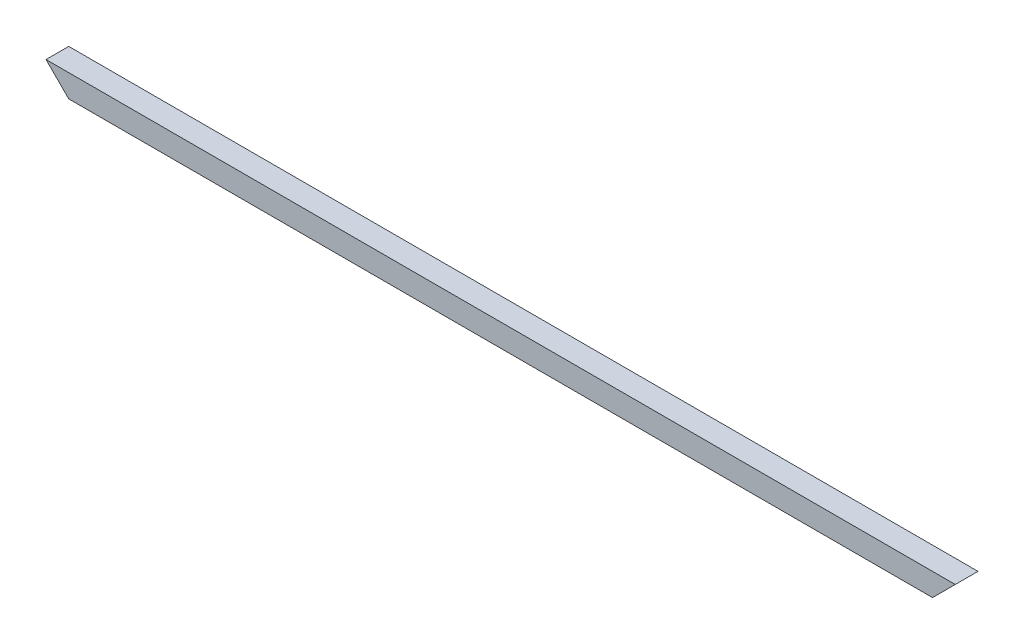
ISO-10303-21;
HEADER;
FILE_DESCRIPTION(('STEP AP214'),'2;1');
FILE_NAME('part.step','',(''),(''),'','','');
FILE_SCHEMA(('AUTOMOTIVE_DESIGN { 1 0 10303 214 1 1 1 1 }'));
ENDSEC;
DATA;
#1=APPLICATION_CONTEXT('core data for automotive mechanical design processes');
#2=APPLICATION_PROTOCOL_DEFINITION('international standard','automotive_design',2000,#1);
#3=PRODUCT_CONTEXT('',#1,'mechanical');
#4=PRODUCT('Part','Part','',(#3));
#5=PRODUCT_RELATED_PRODUCT_CATEGORY('part','',(#4));
#6=PRODUCT_DEFINITION_FORMATION('','',#4);
#7=PRODUCT_DEFINITION_CONTEXT('part definition',#1,'design');
#8=PRODUCT_DEFINITION('design','',#6,#7);
#9=PRODUCT_DEFINITION_SHAPE('','',#8);
#10=(LENGTH_UNIT() NAMED_UNIT(*) SI_UNIT(.MILLI.,.METRE.));
#11=(NAMED_UNIT(*) PLANE_ANGLE_UNIT() SI_UNIT($,.RADIAN.));
#12=(NAMED_UNIT(*) SI_UNIT($,.STERADIAN.) SOLID_ANGLE_UNIT());
#13=UNCERTAINTY_MEASURE_WITH_UNIT(LENGTH_MEASURE(1.E-05),#10,'distance_accuracy_value','');
#14=(GEOMETRIC_REPRESENTATION_CONTEXT(3) GLOBAL_UNCERTAINTY_ASSIGNED_CONTEXT((#13)) GLOBAL_UNIT_ASSIGNED_CONTEXT((#10,
#11,#12)) REPRESENTATION_CONTEXT('',''));
#15=CARTESIAN_POINT('',(0.,0.,0.));
#16=DIRECTION('',(0.,0.,1.));
#17=DIRECTION('',(1.,0.,0.));
#18=AXIS2_PLACEMENT_3D('',#15,#16,#17);
#19=CARTESIAN_POINT('',(800.,-10.,-10.));
#20=DIRECTION('',(0.,0.,1.));
#21=DIRECTION('',(1.,0.,0.));
#22=AXIS2_PLACEMENT_3D('',#19,#20,#21);
#23=PLANE('',#22);
#24=DIRECTION('',(0.70710678118654,0.707106781186555,0.));
#25=VECTOR('',#24,1.);
#26=CARTESIAN_POINT('',(790.,-2.15105711021124E-13,-10.));
#27=LINE('',#26,#25);
#28=CARTESIAN_POINT('',(780.,-10.,-10.));
#29=VERTEX_POINT('',#28);
#30=CARTESIAN_POINT('',(800.,10.,-10.));
#31=VERTEX_POINT('',#30);
#32=EDGE_CURVE('E114',#29,#31,#27,.T.);
#33=ORIENTED_EDGE('',*,*,#32,.F.);
#34=DIRECTION('',(-1.,0.,0.));
#35=VECTOR('',#34,1.);
#36=CARTESIAN_POINT('',(800.,-10.,-10.));
#37=LINE('',#36,#35);
#38=CARTESIAN_POINT('',(20.0000000000006,-10.,-10.));
#39=VERTEX_POINT('',#38);
#40=EDGE_CURVE('E100',#29,#39,#37,.T.);
#41=ORIENTED_EDGE('',*,*,#40,.T.);
#42=DIRECTION('',(-0.707106781186556,0.707106781186539,0.));
#43=VECTOR('',#42,1.);
#44=CARTESIAN_POINT('',(410.000000000009,-400.,-10.));
#45=LINE('',#44,#43);
#46=CARTESIAN_POINT('',(0.,10.,-10.));
#47=VERTEX_POINT('',#46);
#48=EDGE_CURVE('E157',#39,#47,#45,.T.);
#49=ORIENTED_EDGE('',*,*,#48,.T.);
#50=DIRECTION('',(-1.,0.,0.));
#51=VECTOR('',#50,1.);
#52=CARTESIAN_POINT('',(800.,10.,-10.));
#53=LINE('',#52,#51);
#54=EDGE_CURVE('E116',#31,#47,#53,.T.);
#55=ORIENTED_EDGE('',*,*,#54,.F.);
#56=EDGE_LOOP('',(#33,#41,#49,#55));
#57=FACE_BOUND('',#56,.T.);
#58=ADVANCED_FACE('F38',(#57),#23,.F.);
#59=CARTESIAN_POINT('',(800.,-10.,10.));
#60=DIRECTION('',(0.,0.,-1.));
#61=DIRECTION('',(-1.,0.,0.));
#62=AXIS2_PLACEMENT_3D('',#59,#60,#61);
#63=PLANE('',#62);
#64=DIRECTION('',(-0.70710678118654,-0.707106781186555,0.));
#65=VECTOR('',#64,1.);
#66=CARTESIAN_POINT('',(790.,-2.15105711021124E-13,10.));
#67=LINE('',#66,#65);
#68=CARTESIAN_POINT('',(800.,10.,10.));
#69=VERTEX_POINT('',#68);
#70=CARTESIAN_POINT('',(780.,-10.,10.));
#71=VERTEX_POINT('',#70);
#72=EDGE_CURVE('E120',#69,#71,#67,.T.);
#73=ORIENTED_EDGE('',*,*,#72,.F.);
#74=DIRECTION('',(-1.,0.,0.));
#75=VECTOR('',#74,1.);
#76=CARTESIAN_POINT('',(800.,10.,10.));
#77=LINE('',#76,#75);
#78=CARTESIAN_POINT('',(0.,10.,10.));
#79=VERTEX_POINT('',#78);
#80=EDGE_CURVE('E180',#69,#79,#77,.T.);
#81=ORIENTED_EDGE('',*,*,#80,.T.);
#82=DIRECTION('',(0.707106781186556,-0.707106781186539,0.));
#83=VECTOR('',#82,1.);
#84=CARTESIAN_POINT('',(410.000000000009,-400.,10.));
#85=LINE('',#84,#83);
#86=CARTESIAN_POINT('',(20.0000000000005,-10.,10.));
#87=VERTEX_POINT('',#86);
#88=EDGE_CURVE('E153',#79,#87,#85,.T.);
#89=ORIENTED_EDGE('',*,*,#88,.T.);
#90=DIRECTION('',(-1.,0.,0.));
#91=VECTOR('',#90,1.);
#92=CARTESIAN_POINT('',(800.,-10.,10.));
#93=LINE('',#92,#91);
#94=EDGE_CURVE('E109',#71,#87,#93,.T.);
#95=ORIENTED_EDGE('',*,*,#94,.F.);
#96=EDGE_LOOP('',(#73,#81,#89,#95));
#97=FACE_BOUND('',#96,.T.);
#98=ADVANCED_FACE('F214',(#97),#63,.F.);
#99=CARTESIAN_POINT('',(800.,-10.,10.));
#100=DIRECTION('',(0.,1.,0.));
#101=DIRECTION('',(0.,0.,1.));
#102=AXIS2_PLACEMENT_3D('',#99,#100,#101);
#103=PLANE('',#102);
#104=DIRECTION('',(0.,0.,-1.));
#105=VECTOR('',#104,1.);
#106=CARTESIAN_POINT('',(780.,-10.,1035.62480480947));
#107=LINE('',#106,#105);
#108=EDGE_CURVE('E53',#71,#29,#107,.T.);
#109=ORIENTED_EDGE('',*,*,#108,.F.);
#110=ORIENTED_EDGE('',*,*,#94,.T.);
#111=DIRECTION('',(0.,0.,-1.));
#112=VECTOR('',#111,1.);
#113=CARTESIAN_POINT('',(20.0000000000005,-10.,1035.62480480947));
#114=LINE('',#113,#112);
#115=EDGE_CURVE('E104',#87,#39,#114,.T.);
#116=ORIENTED_EDGE('',*,*,#115,.T.);
#117=ORIENTED_EDGE('',*,*,#40,.F.);
#118=EDGE_LOOP('',(#109,#110,#116,#117));
#119=FACE_BOUND('',#118,.T.);
#120=ADVANCED_FACE('F102',(#119),#103,.F.);
#121=CARTESIAN_POINT('',(800.,-8.8,8.8));
#122=DIRECTION('',(0.,0.,-1.));
#123=DIRECTION('',(-1.,0.,0.));
#124=AXIS2_PLACEMENT_3D('',#121,#122,#123);
#125=PLANE('',#124);
#126=DIRECTION('',(-1.,0.,0.));
#127=VECTOR('',#126,1.);
#128=CARTESIAN_POINT('',(800.,8.8,8.8));
#129=LINE('',#128,#127);
#130=CARTESIAN_POINT('',(798.8,8.8,8.8));
#131=VERTEX_POINT('',#130);
#132=CARTESIAN_POINT('',(1.20000000000009,8.8,8.8));
#133=VERTEX_POINT('',#132);
#134=EDGE_CURVE('E160',#131,#133,#129,.T.);
#135=ORIENTED_EDGE('',*,*,#134,.F.);
#136=DIRECTION('',(-0.70710678118654,-0.707106781186555,0.));
#137=VECTOR('',#136,1.);
#138=CARTESIAN_POINT('',(790.6,0.599999999999797,8.8));
#139=LINE('',#138,#137);
#140=CARTESIAN_POINT('',(781.200000000001,-8.8,8.8));
#141=VERTEX_POINT('',#140);
#142=EDGE_CURVE('E61',#131,#141,#139,.T.);
#143=ORIENTED_EDGE('',*,*,#142,.T.);
#144=DIRECTION('',(-1.,0.,0.));
#145=VECTOR('',#144,1.);
#146=CARTESIAN_POINT('',(800.,-8.8,8.8));
#147=LINE('',#146,#145);
#148=CARTESIAN_POINT('',(18.8000000000005,-8.8,8.8));
#149=VERTEX_POINT('',#148);
#150=EDGE_CURVE('E169',#141,#149,#147,.T.);
#151=ORIENTED_EDGE('',*,*,#150,.T.);
#152=DIRECTION('',(0.707106781186556,-0.707106781186539,0.));
#153=VECTOR('',#152,1.);
#154=CARTESIAN_POINT('',(409.400000000009,-399.4,8.8));
#155=LINE('',#154,#153);
#156=EDGE_CURVE('E149',#133,#149,#155,.T.);
#157=ORIENTED_EDGE('',*,*,#156,.F.);
#158=EDGE_LOOP('',(#135,#143,#151,#157));
#159=FACE_BOUND('',#158,.T.);
#160=ADVANCED_FACE('F198',(#159),#125,.T.);
#161=CARTESIAN_POINT('',(800.,-8.8,8.8));
#162=DIRECTION('',(0.,1.,0.));
#163=DIRECTION('',(0.,0.,1.));
#164=AXIS2_PLACEMENT_3D('',#161,#162,#163);
#165=PLANE('',#164);
#166=ORIENTED_EDGE('',*,*,#150,.F.);
#167=DIRECTION('',(0.,0.,-1.));
#168=VECTOR('',#167,1.);
#169=CARTESIAN_POINT('',(781.200000000001,-8.8,8.8));
#170=LINE('',#169,#168);
#171=CARTESIAN_POINT('',(781.200000000001,-8.8,-8.8));
#172=VERTEX_POINT('',#171);
#173=EDGE_CURVE('E129',#141,#172,#170,.T.);
#174=ORIENTED_EDGE('',*,*,#173,.T.);
#175=DIRECTION('',(-1.,0.,0.));
#176=VECTOR('',#175,1.);
#177=CARTESIAN_POINT('',(800.,-8.8,-8.8));
#178=LINE('',#177,#176);
#179=CARTESIAN_POINT('',(18.8000000000006,-8.79999999999999,-8.8));
#180=VERTEX_POINT('',#179);
#181=EDGE_CURVE('E166',#172,#180,#178,.T.);
#182=ORIENTED_EDGE('',*,*,#181,.T.);
#183=DIRECTION('',(0.,0.,-1.));
#184=VECTOR('',#183,1.);
#185=CARTESIAN_POINT('',(18.8000000000005,-8.8,8.8));
#186=LINE('',#185,#184);
#187=EDGE_CURVE('E145',#149,#180,#186,.T.);
#188=ORIENTED_EDGE('',*,*,#187,.F.);
#189=EDGE_LOOP('',(#166,#174,#182,#188));
#190=FACE_BOUND('',#189,.T.);
#191=ADVANCED_FACE('F202',(#190),#165,.T.);
#192=CARTESIAN_POINT('',(800.,-8.8,-8.8));
#193=DIRECTION('',(0.,0.,1.));
#194=DIRECTION('',(1.,0.,0.));
#195=AXIS2_PLACEMENT_3D('',#192,#193,#194);
#196=PLANE('',#195);
#197=ORIENTED_EDGE('',*,*,#181,.F.);
#198=DIRECTION('',(0.70710678118654,0.707106781186555,0.));
#199=VECTOR('',#198,1.);
#200=CARTESIAN_POINT('',(790.6,0.599999999999797,-8.8));
#201=LINE('',#200,#199);
#202=CARTESIAN_POINT('',(798.8,8.8,-8.8));
#203=VERTEX_POINT('',#202);
#204=EDGE_CURVE('E125',#172,#203,#201,.T.);
#205=ORIENTED_EDGE('',*,*,#204,.T.);
#206=DIRECTION('',(-1.,0.,0.));
#207=VECTOR('',#206,1.);
#208=CARTESIAN_POINT('',(800.,8.8,-8.8));
#209=LINE('',#208,#207);
#210=CARTESIAN_POINT('',(1.20000000000009,8.8,-8.8));
#211=VERTEX_POINT('',#210);
#212=EDGE_CURVE('E163',#203,#211,#209,.T.);
#213=ORIENTED_EDGE('',*,*,#212,.T.);
#214=DIRECTION('',(-0.707106781186556,0.707106781186539,0.));
#215=VECTOR('',#214,1.);
#216=CARTESIAN_POINT('',(409.400000000009,-399.4,-8.8));
#217=LINE('',#216,#215);
#218=EDGE_CURVE('E141',#180,#211,#217,.T.);
#219=ORIENTED_EDGE('',*,*,#218,.F.);
#220=EDGE_LOOP('',(#197,#205,#213,#219));
#221=FACE_BOUND('',#220,.T.);
#222=ADVANCED_FACE('F205',(#221),#196,.T.);
#223=CARTESIAN_POINT('',(800.,8.8,8.8));
#224=DIRECTION('',(0.,-1.,0.));
#225=DIRECTION('',(0.,0.,-1.));
#226=AXIS2_PLACEMENT_3D('',#223,#224,#225);
#227=PLANE('',#226);
#228=ORIENTED_EDGE('',*,*,#212,.F.);
#229=DIRECTION('',(0.,0.,1.));
#230=VECTOR('',#229,1.);
#231=CARTESIAN_POINT('',(798.8,8.8,8.8));
#232=LINE('',#231,#230);
#233=EDGE_CURVE('E11',#203,#131,#232,.T.);
#234=ORIENTED_EDGE('',*,*,#233,.T.);
#235=ORIENTED_EDGE('',*,*,#134,.T.);
#236=DIRECTION('',(0.,0.,1.));
#237=VECTOR('',#236,1.);
#238=CARTESIAN_POINT('',(1.20000000000009,8.8,8.8));
#239=LINE('',#238,#237);
#240=EDGE_CURVE('E46',#211,#133,#239,.T.);
#241=ORIENTED_EDGE('',*,*,#240,.F.);
#242=EDGE_LOOP('',(#228,#234,#235,#241));
#243=FACE_BOUND('',#242,.T.);
#244=ADVANCED_FACE('F195',(#243),#227,.T.);
#245=CARTESIAN_POINT('',(800.,10.,10.));
#246=DIRECTION('',(0.,-1.,0.));
#247=DIRECTION('',(0.,0.,-1.));
#248=AXIS2_PLACEMENT_3D('',#245,#246,#247);
#249=PLANE('',#248);
#250=DIRECTION('',(0.,0.,1.));
#251=VECTOR('',#250,1.);
#252=CARTESIAN_POINT('',(0.,10.,10.));
#253=LINE('',#252,#251);
#254=EDGE_CURVE('E172',#47,#79,#253,.T.);
#255=ORIENTED_EDGE('',*,*,#254,.T.);
#256=ORIENTED_EDGE('',*,*,#80,.F.);
#257=DIRECTION('',(0.,0.,1.));
#258=VECTOR('',#257,1.);
#259=CARTESIAN_POINT('',(800.,10.,10.));
#260=LINE('',#259,#258);
#261=EDGE_CURVE('E110',#31,#69,#260,.T.);
#262=ORIENTED_EDGE('',*,*,#261,.F.);
#263=ORIENTED_EDGE('',*,*,#54,.T.);
#264=EDGE_LOOP('',(#255,#256,#262,#263));
#265=FACE_BOUND('',#264,.T.);
#266=ADVANCED_FACE('F211',(#265),#249,.F.);
#267=CARTESIAN_POINT('',(0.,10.,1035.62480480947));
#268=DIRECTION('',(0.707106781186539,0.707106781186556,0.));
#269=DIRECTION('',(-0.707106781186556,0.707106781186539,0.));
#270=AXIS2_PLACEMENT_3D('',#267,#268,#269);
#271=PLANE('',#270);
#272=ORIENTED_EDGE('',*,*,#240,.T.);
#273=ORIENTED_EDGE('',*,*,#156,.T.);
#274=ORIENTED_EDGE('',*,*,#187,.T.);
#275=ORIENTED_EDGE('',*,*,#218,.T.);
#276=EDGE_LOOP('',(#272,#273,#274,#275));
#277=FACE_BOUND('',#276,.T.);
#278=ORIENTED_EDGE('',*,*,#48,.F.);
#279=ORIENTED_EDGE('',*,*,#115,.F.);
#280=ORIENTED_EDGE('',*,*,#88,.F.);
#281=ORIENTED_EDGE('',*,*,#254,.F.);
#282=EDGE_LOOP('',(#278,#279,#280,#281));
#283=FACE_BOUND('',#282,.T.);
#284=ADVANCED_FACE('F189',(#277,#283),#271,.F.);
#285=CARTESIAN_POINT('',(800.,10.,1035.62480480947));
#286=DIRECTION('',(0.707106781186555,-0.70710678118654,0.));
#287=DIRECTION('',(0.70710678118654,0.707106781186555,0.));
#288=AXIS2_PLACEMENT_3D('',#285,#286,#287);
#289=PLANE('',#288);
#290=ORIENTED_EDGE('',*,*,#142,.F.);
#291=ORIENTED_EDGE('',*,*,#233,.F.);
#292=ORIENTED_EDGE('',*,*,#204,.F.);
#293=ORIENTED_EDGE('',*,*,#173,.F.);
#294=EDGE_LOOP('',(#290,#291,#292,#293));
#295=FACE_BOUND('',#294,.T.);
#296=ORIENTED_EDGE('',*,*,#108,.T.);
#297=ORIENTED_EDGE('',*,*,#32,.T.);
#298=ORIENTED_EDGE('',*,*,#261,.T.);
#299=ORIENTED_EDGE('',*,*,#72,.T.);
#300=EDGE_LOOP('',(#296,#297,#298,#299));
#301=FACE_BOUND('',#300,.T.);
#302=ADVANCED_FACE('F123',(#295,#301),#289,.T.);
#303=CLOSED_SHELL('',(#58,#98,#120,#160,#191,#222,#244,#266,#284,#302));
#304=MANIFOLD_SOLID_BREP('B2',#303);
#305=ADVANCED_BREP_SHAPE_REPRESENTATION('',(#18,#304),#14);
#306=SHAPE_DEFINITION_REPRESENTATION(#9,#305);
ENDSEC;
END-ISO-10303-21;
